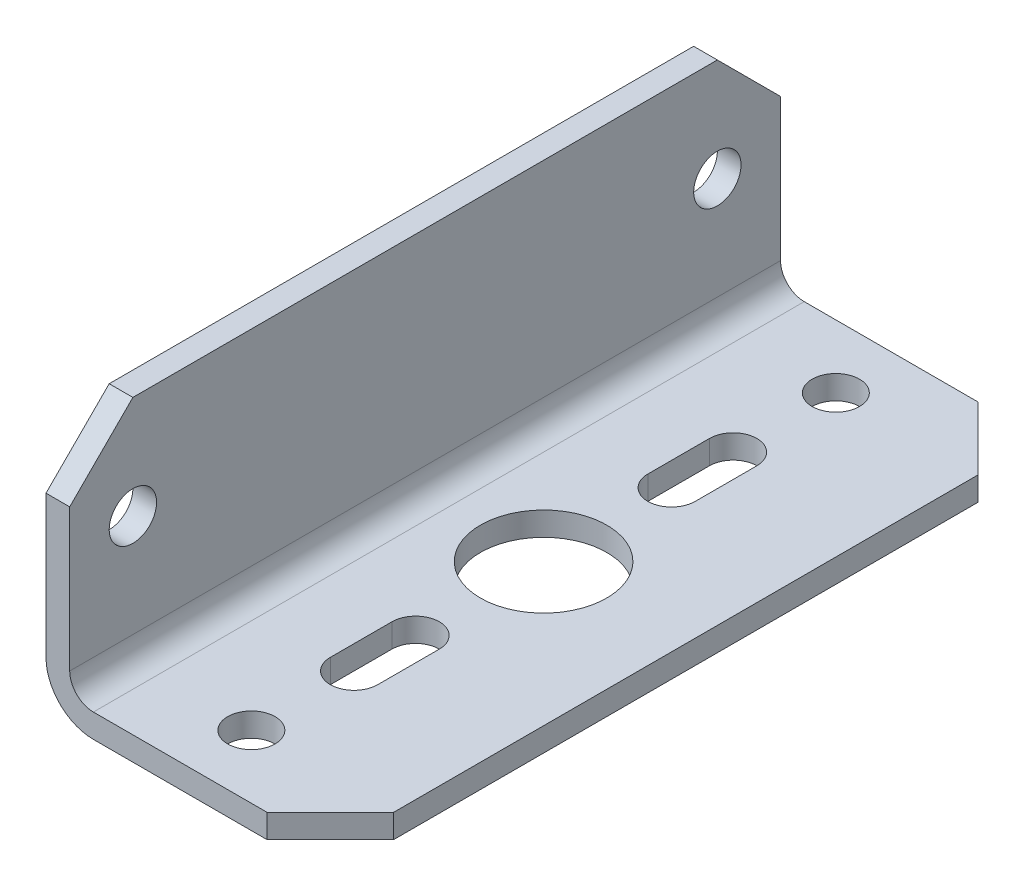
ISO-10303-21;
HEADER;
FILE_DESCRIPTION(('STEP AP214'),'2;1');
FILE_NAME('part.step','',(''),(''),'','','');
FILE_SCHEMA(('AUTOMOTIVE_DESIGN { 1 0 10303 214 1 1 1 1 }'));
ENDSEC;
DATA;
#1=APPLICATION_CONTEXT('core data for automotive mechanical design processes');
#2=APPLICATION_PROTOCOL_DEFINITION('international standard','automotive_design',2000,#1);
#3=PRODUCT_CONTEXT('',#1,'mechanical');
#4=PRODUCT('Part','Part','',(#3));
#5=PRODUCT_RELATED_PRODUCT_CATEGORY('part','',(#4));
#6=PRODUCT_DEFINITION_FORMATION('','',#4);
#7=PRODUCT_DEFINITION_CONTEXT('part definition',#1,'design');
#8=PRODUCT_DEFINITION('design','',#6,#7);
#9=PRODUCT_DEFINITION_SHAPE('','',#8);
#10=(LENGTH_UNIT() NAMED_UNIT(*) SI_UNIT(.MILLI.,.METRE.));
#11=(NAMED_UNIT(*) PLANE_ANGLE_UNIT() SI_UNIT($,.RADIAN.));
#12=(NAMED_UNIT(*) SI_UNIT($,.STERADIAN.) SOLID_ANGLE_UNIT());
#13=UNCERTAINTY_MEASURE_WITH_UNIT(LENGTH_MEASURE(1.E-05),#10,'distance_accuracy_value','');
#14=(GEOMETRIC_REPRESENTATION_CONTEXT(3) GLOBAL_UNCERTAINTY_ASSIGNED_CONTEXT((#13)) GLOBAL_UNIT_ASSIGNED_CONTEXT((#10,
#11,#12)) REPRESENTATION_CONTEXT('',''));
#15=CARTESIAN_POINT('',(0.,0.,0.));
#16=DIRECTION('',(0.,0.,1.));
#17=DIRECTION('',(1.,0.,0.));
#18=AXIS2_PLACEMENT_3D('',#15,#16,#17);
#19=CARTESIAN_POINT('',(0.,0.,22.5));
#20=DIRECTION('',(0.,1.,0.));
#21=DIRECTION('',(0.,0.,1.));
#22=AXIS2_PLACEMENT_3D('',#19,#20,#21);
#23=PLANE('',#22);
#24=CARTESIAN_POINT('',(9.,0.,-18.5));
#25=DIRECTION('',(0.,1.,0.));
#26=DIRECTION('',(0.,0.,1.));
#27=AXIS2_PLACEMENT_3D('',#24,#25,#26);
#28=CIRCLE('',#27,1.5);
#29=CARTESIAN_POINT('',(9.,0.,-17.));
#30=VERTEX_POINT('',#29);
#31=EDGE_CURVE('E262',#30,#30,#28,.T.);
#32=ORIENTED_EDGE('',*,*,#31,.T.);
#33=EDGE_LOOP('',(#32));
#34=FACE_BOUND('',#33,.T.);
#35=DIRECTION('',(0.,0.,1.));
#36=VECTOR('',#35,1.);
#37=CARTESIAN_POINT('',(7.50000000000001,0.,22.5));
#38=LINE('',#37,#36);
#39=CARTESIAN_POINT('',(7.5,0.,8.1));
#40=VERTEX_POINT('',#39);
#41=CARTESIAN_POINT('',(7.5,0.,12.));
#42=VERTEX_POINT('',#41);
#43=EDGE_CURVE('E256',#40,#42,#38,.T.);
#44=ORIENTED_EDGE('',*,*,#43,.T.);
#45=CARTESIAN_POINT('',(9.,0.,12.));
#46=DIRECTION('',(0.,1.,0.));
#47=DIRECTION('',(0.,0.,1.));
#48=AXIS2_PLACEMENT_3D('',#45,#46,#47);
#49=CIRCLE('',#48,1.5);
#50=CARTESIAN_POINT('',(10.5,0.,12.));
#51=VERTEX_POINT('',#50);
#52=EDGE_CURVE('E259',#42,#51,#49,.T.);
#53=ORIENTED_EDGE('',*,*,#52,.T.);
#54=DIRECTION('',(0.,0.,-1.));
#55=VECTOR('',#54,1.);
#56=CARTESIAN_POINT('',(10.5,0.,22.5));
#57=LINE('',#56,#55);
#58=CARTESIAN_POINT('',(10.5,0.,8.1));
#59=VERTEX_POINT('',#58);
#60=EDGE_CURVE('E250',#51,#59,#57,.T.);
#61=ORIENTED_EDGE('',*,*,#60,.T.);
#62=CARTESIAN_POINT('',(9.,0.,8.1));
#63=DIRECTION('',(0.,1.,0.));
#64=DIRECTION('',(0.,0.,1.));
#65=AXIS2_PLACEMENT_3D('',#62,#63,#64);
#66=CIRCLE('',#65,1.5);
#67=EDGE_CURVE('E253',#59,#40,#66,.T.);
#68=ORIENTED_EDGE('',*,*,#67,.T.);
#69=EDGE_LOOP('',(#44,#53,#61,#68));
#70=FACE_BOUND('',#69,.T.);
#71=DIRECTION('',(0.,0.,1.));
#72=VECTOR('',#71,1.);
#73=CARTESIAN_POINT('',(7.5,0.,22.5));
#74=LINE('',#73,#72);
#75=CARTESIAN_POINT('',(7.5,0.,-12.));
#76=VERTEX_POINT('',#75);
#77=CARTESIAN_POINT('',(7.5,0.,-8.1));
#78=VERTEX_POINT('',#77);
#79=EDGE_CURVE('E244',#76,#78,#74,.T.);
#80=ORIENTED_EDGE('',*,*,#79,.T.);
#81=CARTESIAN_POINT('',(9.,0.,-8.1));
#82=DIRECTION('',(0.,1.,0.));
#83=DIRECTION('',(0.,0.,1.));
#84=AXIS2_PLACEMENT_3D('',#81,#82,#83);
#85=CIRCLE('',#84,1.5);
#86=CARTESIAN_POINT('',(10.5,0.,-8.1));
#87=VERTEX_POINT('',#86);
#88=EDGE_CURVE('E247',#78,#87,#85,.T.);
#89=ORIENTED_EDGE('',*,*,#88,.T.);
#90=DIRECTION('',(0.,0.,-1.));
#91=VECTOR('',#90,1.);
#92=CARTESIAN_POINT('',(10.5,0.,22.5));
#93=LINE('',#92,#91);
#94=CARTESIAN_POINT('',(10.5,0.,-12.));
#95=VERTEX_POINT('',#94);
#96=EDGE_CURVE('E241',#87,#95,#93,.T.);
#97=ORIENTED_EDGE('',*,*,#96,.T.);
#98=CARTESIAN_POINT('',(9.,0.,-12.));
#99=DIRECTION('',(0.,1.,0.));
#100=DIRECTION('',(0.,0.,1.));
#101=AXIS2_PLACEMENT_3D('',#98,#99,#100);
#102=CIRCLE('',#101,1.5);
#103=EDGE_CURVE('E178',#95,#76,#102,.T.);
#104=ORIENTED_EDGE('',*,*,#103,.T.);
#105=EDGE_LOOP('',(#80,#89,#97,#104));
#106=FACE_BOUND('',#105,.T.);
#107=CARTESIAN_POINT('',(9.,0.,18.5));
#108=DIRECTION('',(0.,1.,0.));
#109=DIRECTION('',(0.,0.,1.));
#110=AXIS2_PLACEMENT_3D('',#107,#108,#109);
#111=CIRCLE('',#110,1.5);
#112=CARTESIAN_POINT('',(9.,0.,20.));
#113=VERTEX_POINT('',#112);
#114=EDGE_CURVE('E238',#113,#113,#111,.T.);
#115=ORIENTED_EDGE('',*,*,#114,.T.);
#116=EDGE_LOOP('',(#115));
#117=FACE_BOUND('',#116,.T.);
#118=CARTESIAN_POINT('',(9.,0.,0.));
#119=DIRECTION('',(0.,1.,0.));
#120=DIRECTION('',(0.,0.,1.));
#121=AXIS2_PLACEMENT_3D('',#118,#119,#120);
#122=CIRCLE('',#121,4.);
#123=CARTESIAN_POINT('',(9.,0.,4.));
#124=VERTEX_POINT('',#123);
#125=EDGE_CURVE('E235',#124,#124,#122,.T.);
#126=ORIENTED_EDGE('',*,*,#125,.T.);
#127=EDGE_LOOP('',(#126));
#128=FACE_BOUND('',#127,.T.);
#129=DIRECTION('',(1.,0.,0.));
#130=VECTOR('',#129,1.);
#131=CARTESIAN_POINT('',(0.,0.,22.5));
#132=LINE('',#131,#130);
#133=CARTESIAN_POINT('',(3.,0.,22.5));
#134=VERTEX_POINT('',#133);
#135=CARTESIAN_POINT('',(14.,0.,22.5));
#136=VERTEX_POINT('',#135);
#137=EDGE_CURVE('E266',#134,#136,#132,.T.);
#138=ORIENTED_EDGE('',*,*,#137,.F.);
#139=DIRECTION('',(0.,0.,-1.));
#140=VECTOR('',#139,1.);
#141=CARTESIAN_POINT('',(3.,0.,22.5));
#142=LINE('',#141,#140);
#143=CARTESIAN_POINT('',(3.,0.,-22.5));
#144=VERTEX_POINT('',#143);
#145=EDGE_CURVE('E344',#134,#144,#142,.T.);
#146=ORIENTED_EDGE('',*,*,#145,.T.);
#147=DIRECTION('',(1.,0.,0.));
#148=VECTOR('',#147,1.);
#149=CARTESIAN_POINT('',(0.,0.,-22.5));
#150=LINE('',#149,#148);
#151=CARTESIAN_POINT('',(14.,0.,-22.5));
#152=VERTEX_POINT('',#151);
#153=EDGE_CURVE('E265',#144,#152,#150,.T.);
#154=ORIENTED_EDGE('',*,*,#153,.T.);
#155=DIRECTION('',(-0.707106781186549,0.,-0.707106781186546));
#156=VECTOR('',#155,1.);
#157=CARTESIAN_POINT('',(18.,0.,-18.5));
#158=LINE('',#157,#156);
#159=CARTESIAN_POINT('',(18.,0.,-18.5));
#160=VERTEX_POINT('',#159);
#161=EDGE_CURVE('E333',#152,#160,#158,.F.);
#162=ORIENTED_EDGE('',*,*,#161,.T.);
#163=DIRECTION('',(0.,0.,-1.));
#164=VECTOR('',#163,1.);
#165=CARTESIAN_POINT('',(18.,0.,22.5));
#166=LINE('',#165,#164);
#167=CARTESIAN_POINT('',(18.,0.,18.5));
#168=VERTEX_POINT('',#167);
#169=EDGE_CURVE('E292',#168,#160,#166,.T.);
#170=ORIENTED_EDGE('',*,*,#169,.F.);
#171=DIRECTION('',(-0.707106781186546,0.,0.707106781186549));
#172=VECTOR('',#171,1.);
#173=CARTESIAN_POINT('',(14.,0.,22.5));
#174=LINE('',#173,#172);
#175=EDGE_CURVE('E330',#168,#136,#174,.T.);
#176=ORIENTED_EDGE('',*,*,#175,.T.);
#177=EDGE_LOOP('',(#138,#146,#154,#162,#170,#176));
#178=FACE_BOUND('',#177,.T.);
#179=ADVANCED_FACE('F33',(#34,#70,#106,#117,#128,#178),#23,.F.);
#180=CARTESIAN_POINT('',(18.,0.,22.5));
#181=DIRECTION('',(-1.,0.,0.));
#182=DIRECTION('',(0.,0.,1.));
#183=AXIS2_PLACEMENT_3D('',#180,#181,#182);
#184=PLANE('',#183);
#185=ORIENTED_EDGE('',*,*,#169,.T.);
#186=DIRECTION('',(0.,1.,0.));
#187=VECTOR('',#186,1.);
#188=CARTESIAN_POINT('',(18.,0.,-18.5));
#189=LINE('',#188,#187);
#190=CARTESIAN_POINT('',(18.,1.5,-18.5));
#191=VERTEX_POINT('',#190);
#192=EDGE_CURVE('E323',#160,#191,#189,.T.);
#193=ORIENTED_EDGE('',*,*,#192,.T.);
#194=DIRECTION('',(0.,0.,-1.));
#195=VECTOR('',#194,1.);
#196=CARTESIAN_POINT('',(18.,1.5,22.5));
#197=LINE('',#196,#195);
#198=CARTESIAN_POINT('',(18.,1.5,18.5));
#199=VERTEX_POINT('',#198);
#200=EDGE_CURVE('E289',#199,#191,#197,.T.);
#201=ORIENTED_EDGE('',*,*,#200,.F.);
#202=DIRECTION('',(0.,-1.,0.));
#203=VECTOR('',#202,1.);
#204=CARTESIAN_POINT('',(18.,0.,18.5));
#205=LINE('',#204,#203);
#206=EDGE_CURVE('E321',#199,#168,#205,.T.);
#207=ORIENTED_EDGE('',*,*,#206,.T.);
#208=EDGE_LOOP('',(#185,#193,#201,#207));
#209=FACE_BOUND('',#208,.T.);
#210=ADVANCED_FACE('F362',(#209),#184,.F.);
#211=CARTESIAN_POINT('',(18.,1.5,22.5));
#212=DIRECTION('',(0.,-1.,0.));
#213=DIRECTION('',(0.,0.,-1.));
#214=AXIS2_PLACEMENT_3D('',#211,#212,#213);
#215=PLANE('',#214);
#216=CARTESIAN_POINT('',(9.,1.5,-18.5));
#217=DIRECTION('',(0.,1.,0.));
#218=DIRECTION('',(0.,0.,1.));
#219=AXIS2_PLACEMENT_3D('',#216,#217,#218);
#220=CIRCLE('',#219,1.5);
#221=CARTESIAN_POINT('',(9.,1.5,-17.));
#222=VERTEX_POINT('',#221);
#223=EDGE_CURVE('E210',#222,#222,#220,.T.);
#224=ORIENTED_EDGE('',*,*,#223,.F.);
#225=EDGE_LOOP('',(#224));
#226=FACE_BOUND('',#225,.T.);
#227=DIRECTION('',(0.,0.,-1.));
#228=VECTOR('',#227,1.);
#229=CARTESIAN_POINT('',(10.5,1.5,12.));
#230=LINE('',#229,#228);
#231=CARTESIAN_POINT('',(10.5,1.5,12.));
#232=VERTEX_POINT('',#231);
#233=CARTESIAN_POINT('',(10.5,1.5,8.1));
#234=VERTEX_POINT('',#233);
#235=EDGE_CURVE('E216',#232,#234,#230,.T.);
#236=ORIENTED_EDGE('',*,*,#235,.F.);
#237=CARTESIAN_POINT('',(9.,1.5,12.));
#238=DIRECTION('',(0.,1.,0.));
#239=DIRECTION('',(0.,0.,-1.));
#240=AXIS2_PLACEMENT_3D('',#237,#238,#239);
#241=CIRCLE('',#240,1.5);
#242=CARTESIAN_POINT('',(7.5,1.5,12.));
#243=VERTEX_POINT('',#242);
#244=EDGE_CURVE('E203',#243,#232,#241,.T.);
#245=ORIENTED_EDGE('',*,*,#244,.F.);
#246=DIRECTION('',(0.,0.,1.));
#247=VECTOR('',#246,1.);
#248=CARTESIAN_POINT('',(7.5,1.5,8.1));
#249=LINE('',#248,#247);
#250=CARTESIAN_POINT('',(7.5,1.5,8.1));
#251=VERTEX_POINT('',#250);
#252=EDGE_CURVE('E222',#251,#243,#249,.T.);
#253=ORIENTED_EDGE('',*,*,#252,.F.);
#254=CARTESIAN_POINT('',(9.,1.5,8.1));
#255=DIRECTION('',(0.,1.,0.));
#256=DIRECTION('',(0.,0.,-1.));
#257=AXIS2_PLACEMENT_3D('',#254,#255,#256);
#258=CIRCLE('',#257,1.5);
#259=EDGE_CURVE('E219',#234,#251,#258,.T.);
#260=ORIENTED_EDGE('',*,*,#259,.F.);
#261=EDGE_LOOP('',(#236,#245,#253,#260));
#262=FACE_BOUND('',#261,.T.);
#263=DIRECTION('',(0.,0.,-1.));
#264=VECTOR('',#263,1.);
#265=CARTESIAN_POINT('',(10.5,1.5,-12.));
#266=LINE('',#265,#264);
#267=CARTESIAN_POINT('',(10.5,1.5,-8.1));
#268=VERTEX_POINT('',#267);
#269=CARTESIAN_POINT('',(10.5,1.5,-12.));
#270=VERTEX_POINT('',#269);
#271=EDGE_CURVE('E186',#268,#270,#266,.T.);
#272=ORIENTED_EDGE('',*,*,#271,.F.);
#273=CARTESIAN_POINT('',(9.,1.5,-8.1));
#274=DIRECTION('',(0.,1.,0.));
#275=DIRECTION('',(0.,0.,1.));
#276=AXIS2_PLACEMENT_3D('',#273,#274,#275);
#277=CIRCLE('',#276,1.5);
#278=CARTESIAN_POINT('',(7.5,1.5,-8.1));
#279=VERTEX_POINT('',#278);
#280=EDGE_CURVE('E191',#279,#268,#277,.T.);
#281=ORIENTED_EDGE('',*,*,#280,.F.);
#282=DIRECTION('',(0.,0.,1.));
#283=VECTOR('',#282,1.);
#284=CARTESIAN_POINT('',(7.5,1.5,-8.1));
#285=LINE('',#284,#283);
#286=CARTESIAN_POINT('',(7.5,1.5,-12.));
#287=VERTEX_POINT('',#286);
#288=EDGE_CURVE('E196',#287,#279,#285,.T.);
#289=ORIENTED_EDGE('',*,*,#288,.F.);
#290=CARTESIAN_POINT('',(9.,1.5,-12.));
#291=DIRECTION('',(0.,1.,0.));
#292=DIRECTION('',(0.,0.,1.));
#293=AXIS2_PLACEMENT_3D('',#290,#291,#292);
#294=CIRCLE('',#293,1.5);
#295=EDGE_CURVE('E175',#270,#287,#294,.T.);
#296=ORIENTED_EDGE('',*,*,#295,.F.);
#297=EDGE_LOOP('',(#272,#281,#289,#296));
#298=FACE_BOUND('',#297,.T.);
#299=CARTESIAN_POINT('',(9.,1.5,18.5));
#300=DIRECTION('',(0.,1.,0.));
#301=DIRECTION('',(0.,0.,-1.));
#302=AXIS2_PLACEMENT_3D('',#299,#300,#301);
#303=CIRCLE('',#302,1.5);
#304=CARTESIAN_POINT('',(9.,1.5,17.));
#305=VERTEX_POINT('',#304);
#306=EDGE_CURVE('E206',#305,#305,#303,.T.);
#307=ORIENTED_EDGE('',*,*,#306,.F.);
#308=EDGE_LOOP('',(#307));
#309=FACE_BOUND('',#308,.T.);
#310=CARTESIAN_POINT('',(9.,1.5,0.));
#311=DIRECTION('',(0.,1.,0.));
#312=DIRECTION('',(0.,0.,1.));
#313=AXIS2_PLACEMENT_3D('',#310,#311,#312);
#314=CIRCLE('',#313,4.);
#315=CARTESIAN_POINT('',(9.,1.5,4.));
#316=VERTEX_POINT('',#315);
#317=EDGE_CURVE('E213',#316,#316,#314,.T.);
#318=ORIENTED_EDGE('',*,*,#317,.F.);
#319=EDGE_LOOP('',(#318));
#320=FACE_BOUND('',#319,.T.);
#321=DIRECTION('',(-1.,0.,0.));
#322=VECTOR('',#321,1.);
#323=CARTESIAN_POINT('',(18.,1.5,-22.5));
#324=LINE('',#323,#322);
#325=CARTESIAN_POINT('',(14.,1.5,-22.5));
#326=VERTEX_POINT('',#325);
#327=CARTESIAN_POINT('',(3.,1.5,-22.5));
#328=VERTEX_POINT('',#327);
#329=EDGE_CURVE('E278',#326,#328,#324,.T.);
#330=ORIENTED_EDGE('',*,*,#329,.T.);
#331=DIRECTION('',(0.,0.,-1.));
#332=VECTOR('',#331,1.);
#333=CARTESIAN_POINT('',(3.,1.5,22.5));
#334=LINE('',#333,#332);
#335=CARTESIAN_POINT('',(3.,1.5,22.5));
#336=VERTEX_POINT('',#335);
#337=EDGE_CURVE('E338',#328,#336,#334,.F.);
#338=ORIENTED_EDGE('',*,*,#337,.T.);
#339=DIRECTION('',(-1.,0.,0.));
#340=VECTOR('',#339,1.);
#341=CARTESIAN_POINT('',(18.,1.5,22.5));
#342=LINE('',#341,#340);
#343=CARTESIAN_POINT('',(14.,1.5,22.5));
#344=VERTEX_POINT('',#343);
#345=EDGE_CURVE('E268',#344,#336,#342,.T.);
#346=ORIENTED_EDGE('',*,*,#345,.F.);
#347=DIRECTION('',(0.707106781186546,0.,-0.707106781186549));
#348=VECTOR('',#347,1.);
#349=CARTESIAN_POINT('',(14.,1.5,22.5));
#350=LINE('',#349,#348);
#351=EDGE_CURVE('E326',#344,#199,#350,.T.);
#352=ORIENTED_EDGE('',*,*,#351,.T.);
#353=ORIENTED_EDGE('',*,*,#200,.T.);
#354=DIRECTION('',(0.707106781186549,0.,0.707106781186546));
#355=VECTOR('',#354,1.);
#356=CARTESIAN_POINT('',(18.,1.5,-18.5));
#357=LINE('',#356,#355);
#358=EDGE_CURVE('E328',#191,#326,#357,.F.);
#359=ORIENTED_EDGE('',*,*,#358,.T.);
#360=EDGE_LOOP('',(#330,#338,#346,#352,#353,#359));
#361=FACE_BOUND('',#360,.T.);
#362=ADVANCED_FACE('F193',(#226,#262,#298,#309,#320,#361),#215,.F.);
#363=CARTESIAN_POINT('',(1.5,16.,22.5));
#364=DIRECTION('',(-1.,0.,0.));
#365=DIRECTION('',(0.,0.,1.));
#366=AXIS2_PLACEMENT_3D('',#363,#364,#365);
#367=PLANE('',#366);
#368=CARTESIAN_POINT('',(1.5,9.5,-18.5));
#369=DIRECTION('',(-1.,0.,0.));
#370=DIRECTION('',(0.,0.,1.));
#371=AXIS2_PLACEMENT_3D('',#368,#369,#370);
#372=CIRCLE('',#371,1.5);
#373=CARTESIAN_POINT('',(1.5,9.5,-17.));
#374=VERTEX_POINT('',#373);
#375=EDGE_CURVE('E209',#374,#374,#372,.T.);
#376=ORIENTED_EDGE('',*,*,#375,.T.);
#377=EDGE_LOOP('',(#376));
#378=FACE_BOUND('',#377,.T.);
#379=CARTESIAN_POINT('',(1.5,9.5,18.5));
#380=DIRECTION('',(-1.,0.,0.));
#381=DIRECTION('',(0.,0.,1.));
#382=AXIS2_PLACEMENT_3D('',#379,#380,#381);
#383=CIRCLE('',#382,1.5);
#384=CARTESIAN_POINT('',(1.5,9.5,20.));
#385=VERTEX_POINT('',#384);
#386=EDGE_CURVE('E565',#385,#385,#383,.T.);
#387=ORIENTED_EDGE('',*,*,#386,.T.);
#388=EDGE_LOOP('',(#387));
#389=FACE_BOUND('',#388,.T.);
#390=DIRECTION('',(0.,1.,0.));
#391=VECTOR('',#390,1.);
#392=CARTESIAN_POINT('',(1.5,16.,22.5));
#393=LINE('',#392,#391);
#394=CARTESIAN_POINT('',(1.5,3.,22.5));
#395=VERTEX_POINT('',#394);
#396=CARTESIAN_POINT('',(1.5,12.,22.5));
#397=VERTEX_POINT('',#396);
#398=EDGE_CURVE('E272',#395,#397,#393,.T.);
#399=ORIENTED_EDGE('',*,*,#398,.F.);
#400=DIRECTION('',(0.,0.,-1.));
#401=VECTOR('',#400,1.);
#402=CARTESIAN_POINT('',(1.5,3.,-22.5));
#403=LINE('',#402,#401);
#404=CARTESIAN_POINT('',(1.5,3.,-22.5));
#405=VERTEX_POINT('',#404);
#406=EDGE_CURVE('E335',#395,#405,#403,.T.);
#407=ORIENTED_EDGE('',*,*,#406,.T.);
#408=DIRECTION('',(0.,1.,0.));
#409=VECTOR('',#408,1.);
#410=CARTESIAN_POINT('',(1.5,16.,-22.5));
#411=LINE('',#410,#409);
#412=CARTESIAN_POINT('',(1.5,12.,-22.5));
#413=VERTEX_POINT('',#412);
#414=EDGE_CURVE('E281',#405,#413,#411,.T.);
#415=ORIENTED_EDGE('',*,*,#414,.T.);
#416=DIRECTION('',(0.,-0.707106781186549,-0.707106781186546));
#417=VECTOR('',#416,1.);
#418=CARTESIAN_POINT('',(1.5,16.,-18.5));
#419=LINE('',#418,#417);
#420=CARTESIAN_POINT('',(1.5,16.,-18.5));
#421=VERTEX_POINT('',#420);
#422=EDGE_CURVE('E310',#413,#421,#419,.F.);
#423=ORIENTED_EDGE('',*,*,#422,.T.);
#424=DIRECTION('',(0.,0.,-1.));
#425=VECTOR('',#424,1.);
#426=CARTESIAN_POINT('',(1.5,16.,22.5));
#427=LINE('',#426,#425);
#428=CARTESIAN_POINT('',(1.5,16.,18.5));
#429=VERTEX_POINT('',#428);
#430=EDGE_CURVE('E286',#429,#421,#427,.T.);
#431=ORIENTED_EDGE('',*,*,#430,.F.);
#432=DIRECTION('',(0.,-0.707106781186546,0.707106781186549));
#433=VECTOR('',#432,1.);
#434=CARTESIAN_POINT('',(1.5,12.,22.5));
#435=LINE('',#434,#433);
#436=EDGE_CURVE('E312',#429,#397,#435,.T.);
#437=ORIENTED_EDGE('',*,*,#436,.T.);
#438=EDGE_LOOP('',(#399,#407,#415,#423,#431,#437));
#439=FACE_BOUND('',#438,.T.);
#440=ADVANCED_FACE('F379',(#378,#389,#439),#367,.F.);
#441=CARTESIAN_POINT('',(0.,16.,22.5));
#442=DIRECTION('',(0.,-1.,0.));
#443=DIRECTION('',(0.,0.,-1.));
#444=AXIS2_PLACEMENT_3D('',#441,#442,#443);
#445=PLANE('',#444);
#446=DIRECTION('',(0.,0.,-1.));
#447=VECTOR('',#446,1.);
#448=CARTESIAN_POINT('',(0.,16.,22.5));
#449=LINE('',#448,#447);
#450=CARTESIAN_POINT('',(0.,16.,18.5));
#451=VERTEX_POINT('',#450);
#452=CARTESIAN_POINT('',(0.,16.,-18.5));
#453=VERTEX_POINT('',#452);
#454=EDGE_CURVE('E276',#451,#453,#449,.T.);
#455=ORIENTED_EDGE('',*,*,#454,.F.);
#456=DIRECTION('',(1.,0.,0.));
#457=VECTOR('',#456,1.);
#458=CARTESIAN_POINT('',(1.5,16.,18.5));
#459=LINE('',#458,#457);
#460=EDGE_CURVE('E308',#451,#429,#459,.T.);
#461=ORIENTED_EDGE('',*,*,#460,.T.);
#462=ORIENTED_EDGE('',*,*,#430,.T.);
#463=DIRECTION('',(-1.,0.,0.));
#464=VECTOR('',#463,1.);
#465=CARTESIAN_POINT('',(0.,16.,-18.5));
#466=LINE('',#465,#464);
#467=EDGE_CURVE('E305',#421,#453,#466,.T.);
#468=ORIENTED_EDGE('',*,*,#467,.T.);
#469=EDGE_LOOP('',(#455,#461,#462,#468));
#470=FACE_BOUND('',#469,.T.);
#471=ADVANCED_FACE('F390',(#470),#445,.F.);
#472=CARTESIAN_POINT('',(0.,0.,22.5));
#473=DIRECTION('',(1.,0.,0.));
#474=DIRECTION('',(0.,0.,-1.));
#475=AXIS2_PLACEMENT_3D('',#472,#473,#474);
#476=PLANE('',#475);
#477=CARTESIAN_POINT('',(0.,9.5,-18.5));
#478=DIRECTION('',(-1.,0.,0.));
#479=DIRECTION('',(0.,0.,1.));
#480=AXIS2_PLACEMENT_3D('',#477,#478,#479);
#481=CIRCLE('',#480,1.5);
#482=CARTESIAN_POINT('',(0.,9.5,-17.));
#483=VERTEX_POINT('',#482);
#484=EDGE_CURVE('E568',#483,#483,#481,.T.);
#485=ORIENTED_EDGE('',*,*,#484,.F.);
#486=EDGE_LOOP('',(#485));
#487=FACE_BOUND('',#486,.T.);
#488=CARTESIAN_POINT('',(0.,9.5,18.5));
#489=DIRECTION('',(-1.,0.,0.));
#490=DIRECTION('',(0.,0.,1.));
#491=AXIS2_PLACEMENT_3D('',#488,#489,#490);
#492=CIRCLE('',#491,1.5);
#493=CARTESIAN_POINT('',(0.,9.5,20.));
#494=VERTEX_POINT('',#493);
#495=EDGE_CURVE('E569',#494,#494,#492,.T.);
#496=ORIENTED_EDGE('',*,*,#495,.F.);
#497=EDGE_LOOP('',(#496));
#498=FACE_BOUND('',#497,.T.);
#499=DIRECTION('',(0.,-1.,0.));
#500=VECTOR('',#499,1.);
#501=CARTESIAN_POINT('',(0.,0.,-22.5));
#502=LINE('',#501,#500);
#503=CARTESIAN_POINT('',(0.,12.,-22.5));
#504=VERTEX_POINT('',#503);
#505=CARTESIAN_POINT('',(0.,3.,-22.5));
#506=VERTEX_POINT('',#505);
#507=EDGE_CURVE('E269',#504,#506,#502,.T.);
#508=ORIENTED_EDGE('',*,*,#507,.T.);
#509=DIRECTION('',(0.,0.,-1.));
#510=VECTOR('',#509,1.);
#511=CARTESIAN_POINT('',(0.,3.,22.5));
#512=LINE('',#511,#510);
#513=CARTESIAN_POINT('',(0.,3.,22.5));
#514=VERTEX_POINT('',#513);
#515=EDGE_CURVE('E41',#506,#514,#512,.F.);
#516=ORIENTED_EDGE('',*,*,#515,.T.);
#517=DIRECTION('',(0.,-1.,0.));
#518=VECTOR('',#517,1.);
#519=CARTESIAN_POINT('',(0.,0.,22.5));
#520=LINE('',#519,#518);
#521=CARTESIAN_POINT('',(0.,12.,22.5));
#522=VERTEX_POINT('',#521);
#523=EDGE_CURVE('E274',#522,#514,#520,.T.);
#524=ORIENTED_EDGE('',*,*,#523,.F.);
#525=DIRECTION('',(0.,0.707106781186546,-0.707106781186549));
#526=VECTOR('',#525,1.);
#527=CARTESIAN_POINT('',(0.,12.,22.5));
#528=LINE('',#527,#526);
#529=EDGE_CURVE('E303',#522,#451,#528,.T.);
#530=ORIENTED_EDGE('',*,*,#529,.T.);
#531=ORIENTED_EDGE('',*,*,#454,.T.);
#532=DIRECTION('',(0.,0.707106781186549,0.707106781186546));
#533=VECTOR('',#532,1.);
#534=CARTESIAN_POINT('',(0.,16.,-18.5));
#535=LINE('',#534,#533);
#536=EDGE_CURVE('E301',#453,#504,#535,.F.);
#537=ORIENTED_EDGE('',*,*,#536,.T.);
#538=EDGE_LOOP('',(#508,#516,#524,#530,#531,#537));
#539=FACE_BOUND('',#538,.T.);
#540=ADVANCED_FACE('F387',(#487,#498,#539),#476,.F.);
#541=CARTESIAN_POINT('',(0.,0.,22.5));
#542=DIRECTION('',(0.,0.,1.));
#543=DIRECTION('',(1.,0.,0.));
#544=AXIS2_PLACEMENT_3D('',#541,#542,#543);
#545=PLANE('',#544);
#546=ORIENTED_EDGE('',*,*,#523,.T.);
#547=CARTESIAN_POINT('',(3.,3.,22.5));
#548=DIRECTION('',(0.,0.,1.));
#549=DIRECTION('',(1.,0.,0.));
#550=AXIS2_PLACEMENT_3D('',#547,#548,#549);
#551=CIRCLE('',#550,3.);
#552=EDGE_CURVE('E11',#514,#134,#551,.T.);
#553=ORIENTED_EDGE('',*,*,#552,.T.);
#554=ORIENTED_EDGE('',*,*,#137,.T.);
#555=DIRECTION('',(0.,1.,0.));
#556=VECTOR('',#555,1.);
#557=CARTESIAN_POINT('',(14.,1.5,22.5));
#558=LINE('',#557,#556);
#559=EDGE_CURVE('E295',#136,#344,#558,.T.);
#560=ORIENTED_EDGE('',*,*,#559,.T.);
#561=ORIENTED_EDGE('',*,*,#345,.T.);
#562=CARTESIAN_POINT('',(3.,3.,22.5));
#563=DIRECTION('',(0.,0.,1.));
#564=DIRECTION('',(1.,0.,0.));
#565=AXIS2_PLACEMENT_3D('',#562,#563,#564);
#566=CIRCLE('',#565,1.5);
#567=EDGE_CURVE('E342',#336,#395,#566,.F.);
#568=ORIENTED_EDGE('',*,*,#567,.T.);
#569=ORIENTED_EDGE('',*,*,#398,.T.);
#570=DIRECTION('',(-1.,0.,0.));
#571=VECTOR('',#570,1.);
#572=CARTESIAN_POINT('',(0.,12.,22.5));
#573=LINE('',#572,#571);
#574=EDGE_CURVE('E298',#397,#522,#573,.T.);
#575=ORIENTED_EDGE('',*,*,#574,.T.);
#576=EDGE_LOOP('',(#546,#553,#554,#560,#561,#568,#569,#575));
#577=FACE_BOUND('',#576,.T.);
#578=ADVANCED_FACE('F370',(#577),#545,.T.);
#579=CARTESIAN_POINT('',(0.,0.,-22.5));
#580=DIRECTION('',(0.,0.,1.));
#581=DIRECTION('',(1.,0.,0.));
#582=AXIS2_PLACEMENT_3D('',#579,#580,#581);
#583=PLANE('',#582);
#584=ORIENTED_EDGE('',*,*,#153,.F.);
#585=CARTESIAN_POINT('',(3.,3.,-22.5));
#586=DIRECTION('',(0.,0.,1.));
#587=DIRECTION('',(1.,0.,0.));
#588=AXIS2_PLACEMENT_3D('',#585,#586,#587);
#589=CIRCLE('',#588,3.);
#590=EDGE_CURVE('E55',#144,#506,#589,.F.);
#591=ORIENTED_EDGE('',*,*,#590,.T.);
#592=ORIENTED_EDGE('',*,*,#507,.F.);
#593=DIRECTION('',(1.,0.,0.));
#594=VECTOR('',#593,1.);
#595=CARTESIAN_POINT('',(0.,12.,-22.5));
#596=LINE('',#595,#594);
#597=EDGE_CURVE('E318',#504,#413,#596,.T.);
#598=ORIENTED_EDGE('',*,*,#597,.T.);
#599=ORIENTED_EDGE('',*,*,#414,.F.);
#600=CARTESIAN_POINT('',(3.,3.,-22.5));
#601=DIRECTION('',(0.,0.,1.));
#602=DIRECTION('',(1.,0.,0.));
#603=AXIS2_PLACEMENT_3D('',#600,#601,#602);
#604=CIRCLE('',#603,1.5);
#605=EDGE_CURVE('E340',#405,#328,#604,.T.);
#606=ORIENTED_EDGE('',*,*,#605,.T.);
#607=ORIENTED_EDGE('',*,*,#329,.F.);
#608=DIRECTION('',(0.,-1.,0.));
#609=VECTOR('',#608,1.);
#610=CARTESIAN_POINT('',(14.,0.,-22.5));
#611=LINE('',#610,#609);
#612=EDGE_CURVE('E315',#326,#152,#611,.T.);
#613=ORIENTED_EDGE('',*,*,#612,.T.);
#614=EDGE_LOOP('',(#584,#591,#592,#598,#599,#606,#607,#613));
#615=FACE_BOUND('',#614,.T.);
#616=ADVANCED_FACE('F352',(#615),#583,.F.);
#617=CARTESIAN_POINT('',(9.,-43.7,0.));
#618=DIRECTION('',(0.,1.,0.));
#619=DIRECTION('',(0.,0.,1.));
#620=AXIS2_PLACEMENT_3D('',#617,#618,#619);
#621=CYLINDRICAL_SURFACE('',#620,4.);
#622=ORIENTED_EDGE('',*,*,#317,.T.);
#623=EDGE_LOOP('',(#622));
#624=FACE_BOUND('',#623,.T.);
#625=ORIENTED_EDGE('',*,*,#125,.F.);
#626=EDGE_LOOP('',(#625));
#627=FACE_BOUND('',#626,.T.);
#628=ADVANCED_FACE('F459',(#624,#627),#621,.F.);
#629=CARTESIAN_POINT('',(9.,-43.7,18.5));
#630=DIRECTION('',(0.,1.,0.));
#631=DIRECTION('',(0.,0.,1.));
#632=AXIS2_PLACEMENT_3D('',#629,#630,#631);
#633=CYLINDRICAL_SURFACE('',#632,1.5);
#634=ORIENTED_EDGE('',*,*,#306,.T.);
#635=EDGE_LOOP('',(#634));
#636=FACE_BOUND('',#635,.T.);
#637=ORIENTED_EDGE('',*,*,#114,.F.);
#638=EDGE_LOOP('',(#637));
#639=FACE_BOUND('',#638,.T.);
#640=ADVANCED_FACE('F517',(#636,#639),#633,.F.);
#641=CARTESIAN_POINT('',(9.,-43.7,-8.1));
#642=DIRECTION('',(0.,1.,0.));
#643=DIRECTION('',(0.,0.,1.));
#644=AXIS2_PLACEMENT_3D('',#641,#642,#643);
#645=CYLINDRICAL_SURFACE('',#644,1.5);
#646=DIRECTION('',(0.,1.,0.));
#647=VECTOR('',#646,1.);
#648=CARTESIAN_POINT('',(7.5,-43.7,-8.1));
#649=LINE('',#648,#647);
#650=EDGE_CURVE('E201',#78,#279,#649,.T.);
#651=ORIENTED_EDGE('',*,*,#650,.T.);
#652=ORIENTED_EDGE('',*,*,#280,.T.);
#653=DIRECTION('',(0.,1.,0.));
#654=VECTOR('',#653,1.);
#655=CARTESIAN_POINT('',(10.5,-43.7,-8.1));
#656=LINE('',#655,#654);
#657=EDGE_CURVE('E182',#87,#268,#656,.T.);
#658=ORIENTED_EDGE('',*,*,#657,.F.);
#659=ORIENTED_EDGE('',*,*,#88,.F.);
#660=EDGE_LOOP('',(#651,#652,#658,#659));
#661=FACE_BOUND('',#660,.T.);
#662=ADVANCED_FACE('F508',(#661),#645,.F.);
#663=CARTESIAN_POINT('',(7.5,-43.7,-8.1));
#664=DIRECTION('',(-1.,0.,0.));
#665=DIRECTION('',(0.,0.,1.));
#666=AXIS2_PLACEMENT_3D('',#663,#664,#665);
#667=PLANE('',#666);
#668=DIRECTION('',(0.,1.,0.));
#669=VECTOR('',#668,1.);
#670=CARTESIAN_POINT('',(7.5,-43.7,-12.));
#671=LINE('',#670,#669);
#672=EDGE_CURVE('E181',#76,#287,#671,.T.);
#673=ORIENTED_EDGE('',*,*,#672,.T.);
#674=ORIENTED_EDGE('',*,*,#288,.T.);
#675=ORIENTED_EDGE('',*,*,#650,.F.);
#676=ORIENTED_EDGE('',*,*,#79,.F.);
#677=EDGE_LOOP('',(#673,#674,#675,#676));
#678=FACE_BOUND('',#677,.T.);
#679=ADVANCED_FACE('F505',(#678),#667,.F.);
#680=CARTESIAN_POINT('',(9.,-43.7,-12.));
#681=DIRECTION('',(0.,1.,0.));
#682=DIRECTION('',(0.,0.,1.));
#683=AXIS2_PLACEMENT_3D('',#680,#681,#682);
#684=CYLINDRICAL_SURFACE('',#683,1.5);
#685=DIRECTION('',(0.,1.,0.));
#686=VECTOR('',#685,1.);
#687=CARTESIAN_POINT('',(10.5,-43.7,-12.));
#688=LINE('',#687,#686);
#689=EDGE_CURVE('E170',#95,#270,#688,.T.);
#690=ORIENTED_EDGE('',*,*,#689,.T.);
#691=ORIENTED_EDGE('',*,*,#295,.T.);
#692=ORIENTED_EDGE('',*,*,#672,.F.);
#693=ORIENTED_EDGE('',*,*,#103,.F.);
#694=EDGE_LOOP('',(#690,#691,#692,#693));
#695=FACE_BOUND('',#694,.T.);
#696=ADVANCED_FACE('F172',(#695),#684,.F.);
#697=CARTESIAN_POINT('',(10.5,-43.7,-12.));
#698=DIRECTION('',(1.,0.,0.));
#699=DIRECTION('',(0.,0.,-1.));
#700=AXIS2_PLACEMENT_3D('',#697,#698,#699);
#701=PLANE('',#700);
#702=ORIENTED_EDGE('',*,*,#657,.T.);
#703=ORIENTED_EDGE('',*,*,#271,.T.);
#704=ORIENTED_EDGE('',*,*,#689,.F.);
#705=ORIENTED_EDGE('',*,*,#96,.F.);
#706=EDGE_LOOP('',(#702,#703,#704,#705));
#707=FACE_BOUND('',#706,.T.);
#708=ADVANCED_FACE('F187',(#707),#701,.F.);
#709=CARTESIAN_POINT('',(9.,-43.7,12.));
#710=DIRECTION('',(0.,1.,0.));
#711=DIRECTION('',(0.,0.,1.));
#712=AXIS2_PLACEMENT_3D('',#709,#710,#711);
#713=CYLINDRICAL_SURFACE('',#712,1.5);
#714=DIRECTION('',(0.,1.,0.));
#715=VECTOR('',#714,1.);
#716=CARTESIAN_POINT('',(7.5,-43.7,12.));
#717=LINE('',#716,#715);
#718=EDGE_CURVE('E214',#42,#243,#717,.T.);
#719=ORIENTED_EDGE('',*,*,#718,.T.);
#720=ORIENTED_EDGE('',*,*,#244,.T.);
#721=DIRECTION('',(0.,1.,0.));
#722=VECTOR('',#721,1.);
#723=CARTESIAN_POINT('',(10.5,-43.7,12.));
#724=LINE('',#723,#722);
#725=EDGE_CURVE('E225',#51,#232,#724,.T.);
#726=ORIENTED_EDGE('',*,*,#725,.F.);
#727=ORIENTED_EDGE('',*,*,#52,.F.);
#728=EDGE_LOOP('',(#719,#720,#726,#727));
#729=FACE_BOUND('',#728,.T.);
#730=ADVANCED_FACE('F514',(#729),#713,.F.);
#731=CARTESIAN_POINT('',(7.5,-43.7,8.1));
#732=DIRECTION('',(-1.,0.,0.));
#733=DIRECTION('',(0.,0.,1.));
#734=AXIS2_PLACEMENT_3D('',#731,#732,#733);
#735=PLANE('',#734);
#736=DIRECTION('',(0.,1.,0.));
#737=VECTOR('',#736,1.);
#738=CARTESIAN_POINT('',(7.5,-43.7,8.1));
#739=LINE('',#738,#737);
#740=EDGE_CURVE('E227',#40,#251,#739,.T.);
#741=ORIENTED_EDGE('',*,*,#740,.T.);
#742=ORIENTED_EDGE('',*,*,#252,.T.);
#743=ORIENTED_EDGE('',*,*,#718,.F.);
#744=ORIENTED_EDGE('',*,*,#43,.F.);
#745=EDGE_LOOP('',(#741,#742,#743,#744));
#746=FACE_BOUND('',#745,.T.);
#747=ADVANCED_FACE('F526',(#746),#735,.F.);
#748=CARTESIAN_POINT('',(9.,-43.7,8.1));
#749=DIRECTION('',(0.,1.,0.));
#750=DIRECTION('',(0.,0.,1.));
#751=AXIS2_PLACEMENT_3D('',#748,#749,#750);
#752=CYLINDRICAL_SURFACE('',#751,1.5);
#753=DIRECTION('',(0.,1.,0.));
#754=VECTOR('',#753,1.);
#755=CARTESIAN_POINT('',(10.5,-43.7,8.1));
#756=LINE('',#755,#754);
#757=EDGE_CURVE('E229',#59,#234,#756,.T.);
#758=ORIENTED_EDGE('',*,*,#757,.T.);
#759=ORIENTED_EDGE('',*,*,#259,.T.);
#760=ORIENTED_EDGE('',*,*,#740,.F.);
#761=ORIENTED_EDGE('',*,*,#67,.F.);
#762=EDGE_LOOP('',(#758,#759,#760,#761));
#763=FACE_BOUND('',#762,.T.);
#764=ADVANCED_FACE('F529',(#763),#752,.F.);
#765=CARTESIAN_POINT('',(10.5,-43.7,12.));
#766=DIRECTION('',(1.,0.,0.));
#767=DIRECTION('',(0.,0.,-1.));
#768=AXIS2_PLACEMENT_3D('',#765,#766,#767);
#769=PLANE('',#768);
#770=ORIENTED_EDGE('',*,*,#725,.T.);
#771=ORIENTED_EDGE('',*,*,#235,.T.);
#772=ORIENTED_EDGE('',*,*,#757,.F.);
#773=ORIENTED_EDGE('',*,*,#60,.F.);
#774=EDGE_LOOP('',(#770,#771,#772,#773));
#775=FACE_BOUND('',#774,.T.);
#776=ADVANCED_FACE('F524',(#775),#769,.F.);
#777=CARTESIAN_POINT('',(9.,-43.7,-18.5));
#778=DIRECTION('',(0.,1.,0.));
#779=DIRECTION('',(0.,0.,1.));
#780=AXIS2_PLACEMENT_3D('',#777,#778,#779);
#781=CYLINDRICAL_SURFACE('',#780,1.5);
#782=ORIENTED_EDGE('',*,*,#223,.T.);
#783=EDGE_LOOP('',(#782));
#784=FACE_BOUND('',#783,.T.);
#785=ORIENTED_EDGE('',*,*,#31,.F.);
#786=EDGE_LOOP('',(#785));
#787=FACE_BOUND('',#786,.T.);
#788=ADVANCED_FACE('F417',(#784,#787),#781,.F.);
#789=CARTESIAN_POINT('',(0.,12.,22.5));
#790=DIRECTION('',(0.,0.707106781186549,0.707106781186546));
#791=DIRECTION('',(1.,0.,0.));
#792=AXIS2_PLACEMENT_3D('',#789,#790,#791);
#793=PLANE('',#792);
#794=ORIENTED_EDGE('',*,*,#436,.F.);
#795=ORIENTED_EDGE('',*,*,#460,.F.);
#796=ORIENTED_EDGE('',*,*,#529,.F.);
#797=ORIENTED_EDGE('',*,*,#574,.F.);
#798=EDGE_LOOP('',(#794,#795,#796,#797));
#799=FACE_BOUND('',#798,.T.);
#800=ADVANCED_FACE('F386',(#799),#793,.T.);
#801=CARTESIAN_POINT('',(0.,16.,-18.5));
#802=DIRECTION('',(0.,-0.707106781186546,0.707106781186549));
#803=DIRECTION('',(-1.,0.,0.));
#804=AXIS2_PLACEMENT_3D('',#801,#802,#803);
#805=PLANE('',#804);
#806=ORIENTED_EDGE('',*,*,#422,.F.);
#807=ORIENTED_EDGE('',*,*,#597,.F.);
#808=ORIENTED_EDGE('',*,*,#536,.F.);
#809=ORIENTED_EDGE('',*,*,#467,.F.);
#810=EDGE_LOOP('',(#806,#807,#808,#809));
#811=FACE_BOUND('',#810,.T.);
#812=ADVANCED_FACE('F394',(#811),#805,.F.);
#813=CARTESIAN_POINT('',(18.,0.,-18.5));
#814=DIRECTION('',(-0.707106781186546,0.,0.707106781186549));
#815=DIRECTION('',(0.,1.,0.));
#816=AXIS2_PLACEMENT_3D('',#813,#814,#815);
#817=PLANE('',#816);
#818=ORIENTED_EDGE('',*,*,#161,.F.);
#819=ORIENTED_EDGE('',*,*,#612,.F.);
#820=ORIENTED_EDGE('',*,*,#358,.F.);
#821=ORIENTED_EDGE('',*,*,#192,.F.);
#822=EDGE_LOOP('',(#818,#819,#820,#821));
#823=FACE_BOUND('',#822,.T.);
#824=ADVANCED_FACE('F358',(#823),#817,.F.);
#825=CARTESIAN_POINT('',(14.,0.,22.5));
#826=DIRECTION('',(0.707106781186549,0.,0.707106781186546));
#827=DIRECTION('',(0.,-1.,0.));
#828=AXIS2_PLACEMENT_3D('',#825,#826,#827);
#829=PLANE('',#828);
#830=ORIENTED_EDGE('',*,*,#175,.F.);
#831=ORIENTED_EDGE('',*,*,#206,.F.);
#832=ORIENTED_EDGE('',*,*,#351,.F.);
#833=ORIENTED_EDGE('',*,*,#559,.F.);
#834=EDGE_LOOP('',(#830,#831,#832,#833));
#835=FACE_BOUND('',#834,.T.);
#836=ADVANCED_FACE('F366',(#835),#829,.T.);
#837=CARTESIAN_POINT('',(3.,3.,22.5));
#838=DIRECTION('',(0.,0.,1.));
#839=DIRECTION('',(1.,0.,0.));
#840=AXIS2_PLACEMENT_3D('',#837,#838,#839);
#841=CYLINDRICAL_SURFACE('',#840,1.5);
#842=ORIENTED_EDGE('',*,*,#567,.F.);
#843=ORIENTED_EDGE('',*,*,#337,.F.);
#844=ORIENTED_EDGE('',*,*,#605,.F.);
#845=ORIENTED_EDGE('',*,*,#406,.F.);
#846=EDGE_LOOP('',(#842,#843,#844,#845));
#847=FACE_BOUND('',#846,.T.);
#848=ADVANCED_FACE('F375',(#847),#841,.F.);
#849=CARTESIAN_POINT('',(3.,3.,22.5));
#850=DIRECTION('',(0.,0.,-1.));
#851=DIRECTION('',(-1.,0.,0.));
#852=AXIS2_PLACEMENT_3D('',#849,#850,#851);
#853=CYLINDRICAL_SURFACE('',#852,3.);
#854=ORIENTED_EDGE('',*,*,#552,.F.);
#855=ORIENTED_EDGE('',*,*,#515,.F.);
#856=ORIENTED_EDGE('',*,*,#590,.F.);
#857=ORIENTED_EDGE('',*,*,#145,.F.);
#858=EDGE_LOOP('',(#854,#855,#856,#857));
#859=FACE_BOUND('',#858,.T.);
#860=ADVANCED_FACE('F35',(#859),#853,.T.);
#861=CARTESIAN_POINT('',(18.,9.5,18.5));
#862=DIRECTION('',(-1.,0.,0.));
#863=DIRECTION('',(0.,0.,1.));
#864=AXIS2_PLACEMENT_3D('',#861,#862,#863);
#865=CYLINDRICAL_SURFACE('',#864,1.5);
#866=ORIENTED_EDGE('',*,*,#495,.T.);
#867=EDGE_LOOP('',(#866));
#868=FACE_BOUND('',#867,.T.);
#869=ORIENTED_EDGE('',*,*,#386,.F.);
#870=EDGE_LOOP('',(#869));
#871=FACE_BOUND('',#870,.T.);
#872=ADVANCED_FACE('F397',(#868,#871),#865,.F.);
#873=CARTESIAN_POINT('',(18.,9.5,-18.5));
#874=DIRECTION('',(-1.,0.,0.));
#875=DIRECTION('',(0.,0.,1.));
#876=AXIS2_PLACEMENT_3D('',#873,#874,#875);
#877=CYLINDRICAL_SURFACE('',#876,1.5);
#878=ORIENTED_EDGE('',*,*,#484,.T.);
#879=EDGE_LOOP('',(#878));
#880=FACE_BOUND('',#879,.T.);
#881=ORIENTED_EDGE('',*,*,#375,.F.);
#882=EDGE_LOOP('',(#881));
#883=FACE_BOUND('',#882,.T.);
#884=ADVANCED_FACE('F402',(#880,#883),#877,.F.);
#885=CLOSED_SHELL('',(#179,#210,#362,#440,#471,#540,#578,#616,#628,#640,#662,#679,#696,#708,
#730,#747,#764,#776,#788,#800,#812,#824,#836,#848,#860,#872,#884));
#886=MANIFOLD_SOLID_BREP('B2',#885);
#887=ADVANCED_BREP_SHAPE_REPRESENTATION('',(#18,#886),#14);
#888=SHAPE_DEFINITION_REPRESENTATION(#9,#887);
ENDSEC;
END-ISO-10303-21;
